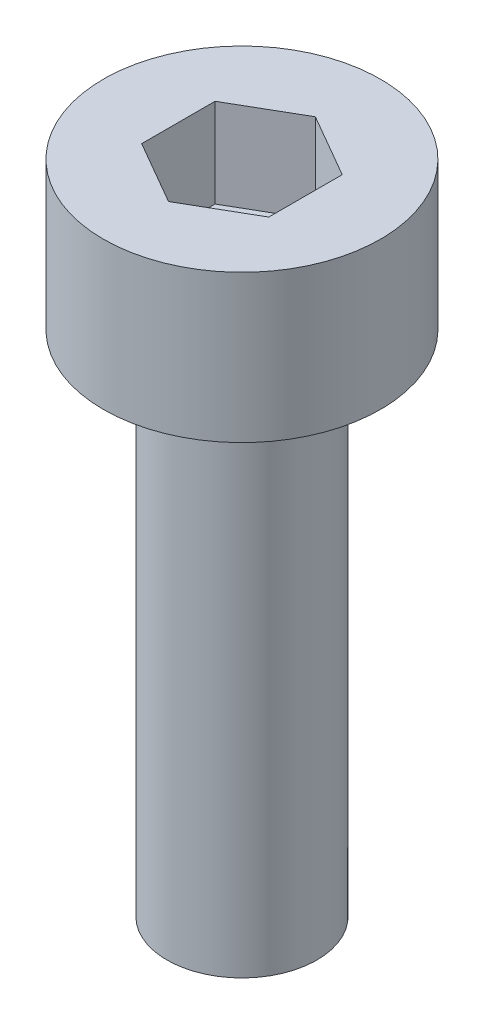
ISO-10303-21;
HEADER;
FILE_DESCRIPTION(('STEP AP214'),'2;1');
FILE_NAME('part.step','',(''),(''),'','','');
FILE_SCHEMA(('AUTOMOTIVE_DESIGN { 1 0 10303 214 1 1 1 1 }'));
ENDSEC;
DATA;
#1=APPLICATION_CONTEXT('core data for automotive mechanical design processes');
#2=APPLICATION_PROTOCOL_DEFINITION('international standard','automotive_design',2000,#1);
#3=PRODUCT_CONTEXT('',#1,'mechanical');
#4=PRODUCT('Part','Part','',(#3));
#5=PRODUCT_RELATED_PRODUCT_CATEGORY('part','',(#4));
#6=PRODUCT_DEFINITION_FORMATION('','',#4);
#7=PRODUCT_DEFINITION_CONTEXT('part definition',#1,'design');
#8=PRODUCT_DEFINITION('design','',#6,#7);
#9=PRODUCT_DEFINITION_SHAPE('','',#8);
#10=(LENGTH_UNIT() NAMED_UNIT(*) SI_UNIT(.MILLI.,.METRE.));
#11=(NAMED_UNIT(*) PLANE_ANGLE_UNIT() SI_UNIT($,.RADIAN.));
#12=(NAMED_UNIT(*) SI_UNIT($,.STERADIAN.) SOLID_ANGLE_UNIT());
#13=UNCERTAINTY_MEASURE_WITH_UNIT(LENGTH_MEASURE(1.E-05),#10,'distance_accuracy_value','');
#14=(GEOMETRIC_REPRESENTATION_CONTEXT(3) GLOBAL_UNCERTAINTY_ASSIGNED_CONTEXT((#13)) GLOBAL_UNIT_ASSIGNED_CONTEXT((#10,
#11,#12)) REPRESENTATION_CONTEXT('',''));
#15=CARTESIAN_POINT('',(0.,0.,0.));
#16=DIRECTION('',(0.,0.,1.));
#17=DIRECTION('',(1.,0.,0.));
#18=AXIS2_PLACEMENT_3D('',#15,#16,#17);
#19=CARTESIAN_POINT('',(0.,2.9,0.));
#20=DIRECTION('',(0.,-1.,0.));
#21=DIRECTION('',(0.,0.,-1.));
#22=AXIS2_PLACEMENT_3D('',#19,#20,#21);
#23=CYLINDRICAL_SURFACE('',#22,2.725);
#24=CARTESIAN_POINT('',(0.,2.9,0.));
#25=DIRECTION('',(0.,1.,0.));
#26=DIRECTION('',(0.,0.,1.));
#27=AXIS2_PLACEMENT_3D('',#24,#25,#26);
#28=CIRCLE('',#27,2.725);
#29=CARTESIAN_POINT('',(0.,2.9,2.725));
#30=VERTEX_POINT('',#29);
#31=EDGE_CURVE('E40',#30,#30,#28,.T.);
#32=ORIENTED_EDGE('',*,*,#31,.F.);
#33=EDGE_LOOP('',(#32));
#34=FACE_BOUND('',#33,.T.);
#35=CARTESIAN_POINT('',(0.,0.,0.));
#36=DIRECTION('',(0.,1.,0.));
#37=DIRECTION('',(0.,0.,1.));
#38=AXIS2_PLACEMENT_3D('',#35,#36,#37);
#39=CIRCLE('',#38,2.725);
#40=CARTESIAN_POINT('',(0.,0.,2.725));
#41=VERTEX_POINT('',#40);
#42=EDGE_CURVE('E35',#41,#41,#39,.T.);
#43=ORIENTED_EDGE('',*,*,#42,.T.);
#44=EDGE_LOOP('',(#43));
#45=FACE_BOUND('',#44,.T.);
#46=ADVANCED_FACE('F32',(#34,#45),#23,.T.);
#47=CARTESIAN_POINT('',(0.,2.9,0.));
#48=DIRECTION('',(0.,1.,0.));
#49=DIRECTION('',(0.,0.,1.));
#50=AXIS2_PLACEMENT_3D('',#47,#48,#49);
#51=PLANE('',#50);
#52=DIRECTION('',(-0.866025403784439,0.,-0.5));
#53=VECTOR('',#52,1.);
#54=CARTESIAN_POINT('',(1.25,2.9,-0.721687836487032));
#55=LINE('',#54,#53);
#56=CARTESIAN_POINT('',(1.25,2.9,-0.721687836487032));
#57=VERTEX_POINT('',#56);
#58=CARTESIAN_POINT('',(0.,2.9,-1.44337567297406));
#59=VERTEX_POINT('',#58);
#60=EDGE_CURVE('E48',#57,#59,#55,.T.);
#61=ORIENTED_EDGE('',*,*,#60,.F.);
#62=DIRECTION('',(0.,0.,-1.));
#63=VECTOR('',#62,1.);
#64=CARTESIAN_POINT('',(1.25,2.9,0.721687836487033));
#65=LINE('',#64,#63);
#66=CARTESIAN_POINT('',(1.25,2.9,0.721687836487033));
#67=VERTEX_POINT('',#66);
#68=EDGE_CURVE('E131',#67,#57,#65,.T.);
#69=ORIENTED_EDGE('',*,*,#68,.F.);
#70=DIRECTION('',(0.866025403784439,0.,-0.5));
#71=VECTOR('',#70,1.);
#72=CARTESIAN_POINT('',(0.,2.9,1.44337567297406));
#73=LINE('',#72,#71);
#74=CARTESIAN_POINT('',(0.,2.9,1.44337567297406));
#75=VERTEX_POINT('',#74);
#76=EDGE_CURVE('E129',#75,#67,#73,.T.);
#77=ORIENTED_EDGE('',*,*,#76,.F.);
#78=DIRECTION('',(0.866025403784439,0.,0.5));
#79=VECTOR('',#78,1.);
#80=CARTESIAN_POINT('',(-1.25,2.9,0.721687836487032));
#81=LINE('',#80,#79);
#82=CARTESIAN_POINT('',(-1.25,2.9,0.721687836487032));
#83=VERTEX_POINT('',#82);
#84=EDGE_CURVE('E96',#83,#75,#81,.T.);
#85=ORIENTED_EDGE('',*,*,#84,.F.);
#86=DIRECTION('',(0.,0.,1.));
#87=VECTOR('',#86,1.);
#88=CARTESIAN_POINT('',(-1.25,2.9,-0.721687836487033));
#89=LINE('',#88,#87);
#90=CARTESIAN_POINT('',(-1.25,2.9,-0.721687836487033));
#91=VERTEX_POINT('',#90);
#92=EDGE_CURVE('E125',#91,#83,#89,.T.);
#93=ORIENTED_EDGE('',*,*,#92,.F.);
#94=DIRECTION('',(-0.866025403784439,0.,0.5));
#95=VECTOR('',#94,1.);
#96=CARTESIAN_POINT('',(0.,2.9,-1.44337567297406));
#97=LINE('',#96,#95);
#98=EDGE_CURVE('E122',#59,#91,#97,.T.);
#99=ORIENTED_EDGE('',*,*,#98,.F.);
#100=EDGE_LOOP('',(#61,#69,#77,#85,#93,#99));
#101=FACE_BOUND('',#100,.T.);
#102=ORIENTED_EDGE('',*,*,#31,.T.);
#103=EDGE_LOOP('',(#102));
#104=FACE_BOUND('',#103,.T.);
#105=ADVANCED_FACE('F152',(#101,#104),#51,.T.);
#106=CARTESIAN_POINT('',(0.,0.,0.));
#107=DIRECTION('',(0.,1.,0.));
#108=DIRECTION('',(0.,0.,1.));
#109=AXIS2_PLACEMENT_3D('',#106,#107,#108);
#110=PLANE('',#109);
#111=CARTESIAN_POINT('',(0.,0.,0.));
#112=DIRECTION('',(0.,-1.,0.));
#113=DIRECTION('',(0.,0.,-1.));
#114=AXIS2_PLACEMENT_3D('',#111,#112,#113);
#115=CIRCLE('',#114,1.475);
#116=CARTESIAN_POINT('',(0.,0.,-1.475));
#117=VERTEX_POINT('',#116);
#118=EDGE_CURVE('E11',#117,#117,#115,.T.);
#119=ORIENTED_EDGE('',*,*,#118,.F.);
#120=EDGE_LOOP('',(#119));
#121=FACE_BOUND('',#120,.T.);
#122=ORIENTED_EDGE('',*,*,#42,.F.);
#123=EDGE_LOOP('',(#122));
#124=FACE_BOUND('',#123,.T.);
#125=ADVANCED_FACE('F149',(#121,#124),#110,.F.);
#126=CARTESIAN_POINT('',(0.,-10.,0.));
#127=DIRECTION('',(0.,1.,0.));
#128=DIRECTION('',(0.,0.,1.));
#129=AXIS2_PLACEMENT_3D('',#126,#127,#128);
#130=CYLINDRICAL_SURFACE('',#129,1.475);
#131=CARTESIAN_POINT('',(0.,-10.,0.));
#132=DIRECTION('',(0.,-1.,0.));
#133=DIRECTION('',(0.,0.,-1.));
#134=AXIS2_PLACEMENT_3D('',#131,#132,#133);
#135=CIRCLE('',#134,1.475);
#136=CARTESIAN_POINT('',(0.,-10.,-1.475));
#137=VERTEX_POINT('',#136);
#138=EDGE_CURVE('E135',#137,#137,#135,.T.);
#139=ORIENTED_EDGE('',*,*,#138,.F.);
#140=EDGE_LOOP('',(#139));
#141=FACE_BOUND('',#140,.T.);
#142=ORIENTED_EDGE('',*,*,#118,.T.);
#143=EDGE_LOOP('',(#142));
#144=FACE_BOUND('',#143,.T.);
#145=ADVANCED_FACE('F151',(#141,#144),#130,.T.);
#146=CARTESIAN_POINT('',(0.,-10.,0.));
#147=DIRECTION('',(0.,-1.,0.));
#148=DIRECTION('',(0.,0.,-1.));
#149=AXIS2_PLACEMENT_3D('',#146,#147,#148);
#150=PLANE('',#149);
#151=ORIENTED_EDGE('',*,*,#138,.T.);
#152=EDGE_LOOP('',(#151));
#153=FACE_BOUND('',#152,.T.);
#154=ADVANCED_FACE('F158',(#153),#150,.T.);
#155=CARTESIAN_POINT('',(1.25,1.15,-0.721687836487032));
#156=DIRECTION('',(0.5,0.,-0.866025403784439));
#157=DIRECTION('',(-0.866025403784439,0.,-0.5));
#158=AXIS2_PLACEMENT_3D('',#155,#156,#157);
#159=PLANE('',#158);
#160=ORIENTED_EDGE('',*,*,#60,.T.);
#161=DIRECTION('',(0.,1.,0.));
#162=VECTOR('',#161,1.);
#163=CARTESIAN_POINT('',(0.,1.15,-1.44337567297406));
#164=LINE('',#163,#162);
#165=CARTESIAN_POINT('',(0.,1.15,-1.44337567297406));
#166=VERTEX_POINT('',#165);
#167=EDGE_CURVE('E78',#166,#59,#164,.T.);
#168=ORIENTED_EDGE('',*,*,#167,.F.);
#169=DIRECTION('',(-0.866025403784439,0.,-0.5));
#170=VECTOR('',#169,1.);
#171=CARTESIAN_POINT('',(1.25,1.15,-0.721687836487032));
#172=LINE('',#171,#170);
#173=CARTESIAN_POINT('',(1.25,1.15,-0.721687836487032));
#174=VERTEX_POINT('',#173);
#175=EDGE_CURVE('E133',#174,#166,#172,.T.);
#176=ORIENTED_EDGE('',*,*,#175,.F.);
#177=DIRECTION('',(0.,1.,0.));
#178=VECTOR('',#177,1.);
#179=CARTESIAN_POINT('',(1.25,1.15,-0.721687836487032));
#180=LINE('',#179,#178);
#181=EDGE_CURVE('E56',#174,#57,#180,.T.);
#182=ORIENTED_EDGE('',*,*,#181,.T.);
#183=EDGE_LOOP('',(#160,#168,#176,#182));
#184=FACE_BOUND('',#183,.T.);
#185=ADVANCED_FACE('F183',(#184),#159,.F.);
#186=CARTESIAN_POINT('',(1.25,1.15,0.721687836487033));
#187=DIRECTION('',(1.,0.,0.));
#188=DIRECTION('',(0.,0.,-1.));
#189=AXIS2_PLACEMENT_3D('',#186,#187,#188);
#190=PLANE('',#189);
#191=ORIENTED_EDGE('',*,*,#68,.T.);
#192=ORIENTED_EDGE('',*,*,#181,.F.);
#193=DIRECTION('',(0.,0.,-1.));
#194=VECTOR('',#193,1.);
#195=CARTESIAN_POINT('',(1.25,1.15,0.721687836487033));
#196=LINE('',#195,#194);
#197=CARTESIAN_POINT('',(1.25,1.15,0.721687836487033));
#198=VERTEX_POINT('',#197);
#199=EDGE_CURVE('E108',#198,#174,#196,.T.);
#200=ORIENTED_EDGE('',*,*,#199,.F.);
#201=DIRECTION('',(0.,1.,0.));
#202=VECTOR('',#201,1.);
#203=CARTESIAN_POINT('',(1.25,1.15,0.721687836487033));
#204=LINE('',#203,#202);
#205=EDGE_CURVE('E100',#198,#67,#204,.T.);
#206=ORIENTED_EDGE('',*,*,#205,.T.);
#207=EDGE_LOOP('',(#191,#192,#200,#206));
#208=FACE_BOUND('',#207,.T.);
#209=ADVANCED_FACE('F188',(#208),#190,.F.);
#210=CARTESIAN_POINT('',(0.,1.15,1.44337567297406));
#211=DIRECTION('',(0.5,0.,0.866025403784439));
#212=DIRECTION('',(0.866025403784439,0.,-0.5));
#213=AXIS2_PLACEMENT_3D('',#210,#211,#212);
#214=PLANE('',#213);
#215=ORIENTED_EDGE('',*,*,#76,.T.);
#216=ORIENTED_EDGE('',*,*,#205,.F.);
#217=DIRECTION('',(0.866025403784439,0.,-0.5));
#218=VECTOR('',#217,1.);
#219=CARTESIAN_POINT('',(0.,1.15,1.44337567297406));
#220=LINE('',#219,#218);
#221=CARTESIAN_POINT('',(0.,1.15,1.44337567297406));
#222=VERTEX_POINT('',#221);
#223=EDGE_CURVE('E104',#222,#198,#220,.T.);
#224=ORIENTED_EDGE('',*,*,#223,.F.);
#225=DIRECTION('',(0.,1.,0.));
#226=VECTOR('',#225,1.);
#227=CARTESIAN_POINT('',(0.,1.15,1.44337567297406));
#228=LINE('',#227,#226);
#229=EDGE_CURVE('E89',#222,#75,#228,.T.);
#230=ORIENTED_EDGE('',*,*,#229,.T.);
#231=EDGE_LOOP('',(#215,#216,#224,#230));
#232=FACE_BOUND('',#231,.T.);
#233=ADVANCED_FACE('F105',(#232),#214,.F.);
#234=CARTESIAN_POINT('',(-1.25,1.15,0.721687836487032));
#235=DIRECTION('',(-0.5,0.,0.866025403784439));
#236=DIRECTION('',(0.866025403784439,0.,0.5));
#237=AXIS2_PLACEMENT_3D('',#234,#235,#236);
#238=PLANE('',#237);
#239=ORIENTED_EDGE('',*,*,#84,.T.);
#240=ORIENTED_EDGE('',*,*,#229,.F.);
#241=DIRECTION('',(0.866025403784439,0.,0.5));
#242=VECTOR('',#241,1.);
#243=CARTESIAN_POINT('',(-1.25,1.15,0.721687836487032));
#244=LINE('',#243,#242);
#245=CARTESIAN_POINT('',(-1.25,1.15,0.721687836487032));
#246=VERTEX_POINT('',#245);
#247=EDGE_CURVE('E93',#246,#222,#244,.T.);
#248=ORIENTED_EDGE('',*,*,#247,.F.);
#249=DIRECTION('',(0.,1.,0.));
#250=VECTOR('',#249,1.);
#251=CARTESIAN_POINT('',(-1.25,1.15,0.721687836487032));
#252=LINE('',#251,#250);
#253=EDGE_CURVE('E101',#246,#83,#252,.T.);
#254=ORIENTED_EDGE('',*,*,#253,.T.);
#255=EDGE_LOOP('',(#239,#240,#248,#254));
#256=FACE_BOUND('',#255,.T.);
#257=ADVANCED_FACE('F91',(#256),#238,.F.);
#258=CARTESIAN_POINT('',(-1.25,1.15,-0.721687836487033));
#259=DIRECTION('',(-1.,0.,0.));
#260=DIRECTION('',(0.,0.,1.));
#261=AXIS2_PLACEMENT_3D('',#258,#259,#260);
#262=PLANE('',#261);
#263=ORIENTED_EDGE('',*,*,#92,.T.);
#264=ORIENTED_EDGE('',*,*,#253,.F.);
#265=DIRECTION('',(0.,0.,1.));
#266=VECTOR('',#265,1.);
#267=CARTESIAN_POINT('',(-1.25,1.15,-0.721687836487033));
#268=LINE('',#267,#266);
#269=CARTESIAN_POINT('',(-1.25,1.15,-0.721687836487033));
#270=VERTEX_POINT('',#269);
#271=EDGE_CURVE('E114',#270,#246,#268,.T.);
#272=ORIENTED_EDGE('',*,*,#271,.F.);
#273=DIRECTION('',(0.,1.,0.));
#274=VECTOR('',#273,1.);
#275=CARTESIAN_POINT('',(-1.25,1.15,-0.721687836487033));
#276=LINE('',#275,#274);
#277=EDGE_CURVE('E138',#270,#91,#276,.T.);
#278=ORIENTED_EDGE('',*,*,#277,.T.);
#279=EDGE_LOOP('',(#263,#264,#272,#278));
#280=FACE_BOUND('',#279,.T.);
#281=ADVANCED_FACE('F213',(#280),#262,.F.);
#282=CARTESIAN_POINT('',(0.,1.15,-1.44337567297406));
#283=DIRECTION('',(-0.5,0.,-0.866025403784439));
#284=DIRECTION('',(-0.866025403784439,0.,0.5));
#285=AXIS2_PLACEMENT_3D('',#282,#283,#284);
#286=PLANE('',#285);
#287=ORIENTED_EDGE('',*,*,#98,.T.);
#288=ORIENTED_EDGE('',*,*,#277,.F.);
#289=DIRECTION('',(-0.866025403784439,0.,0.5));
#290=VECTOR('',#289,1.);
#291=CARTESIAN_POINT('',(0.,1.15,-1.44337567297406));
#292=LINE('',#291,#290);
#293=EDGE_CURVE('E116',#166,#270,#292,.T.);
#294=ORIENTED_EDGE('',*,*,#293,.F.);
#295=ORIENTED_EDGE('',*,*,#167,.T.);
#296=EDGE_LOOP('',(#287,#288,#294,#295));
#297=FACE_BOUND('',#296,.T.);
#298=ADVANCED_FACE('F222',(#297),#286,.F.);
#299=CARTESIAN_POINT('',(0.,1.15,0.));
#300=DIRECTION('',(0.,1.,0.));
#301=DIRECTION('',(0.,0.,1.));
#302=AXIS2_PLACEMENT_3D('',#299,#300,#301);
#303=PLANE('',#302);
#304=ORIENTED_EDGE('',*,*,#175,.T.);
#305=ORIENTED_EDGE('',*,*,#293,.T.);
#306=ORIENTED_EDGE('',*,*,#271,.T.);
#307=ORIENTED_EDGE('',*,*,#247,.T.);
#308=ORIENTED_EDGE('',*,*,#223,.T.);
#309=ORIENTED_EDGE('',*,*,#199,.T.);
#310=EDGE_LOOP('',(#304,#305,#306,#307,#308,#309));
#311=FACE_BOUND('',#310,.T.);
#312=ADVANCED_FACE('F111',(#311),#303,.T.);
#313=CLOSED_SHELL('',(#46,#105,#125,#145,#154,#185,#209,#233,#257,#281,#298,#312));
#314=MANIFOLD_SOLID_BREP('B2',#313);
#315=ADVANCED_BREP_SHAPE_REPRESENTATION('',(#18,#314),#14);
#316=SHAPE_DEFINITION_REPRESENTATION(#9,#315);
ENDSEC;
END-ISO-10303-21;
